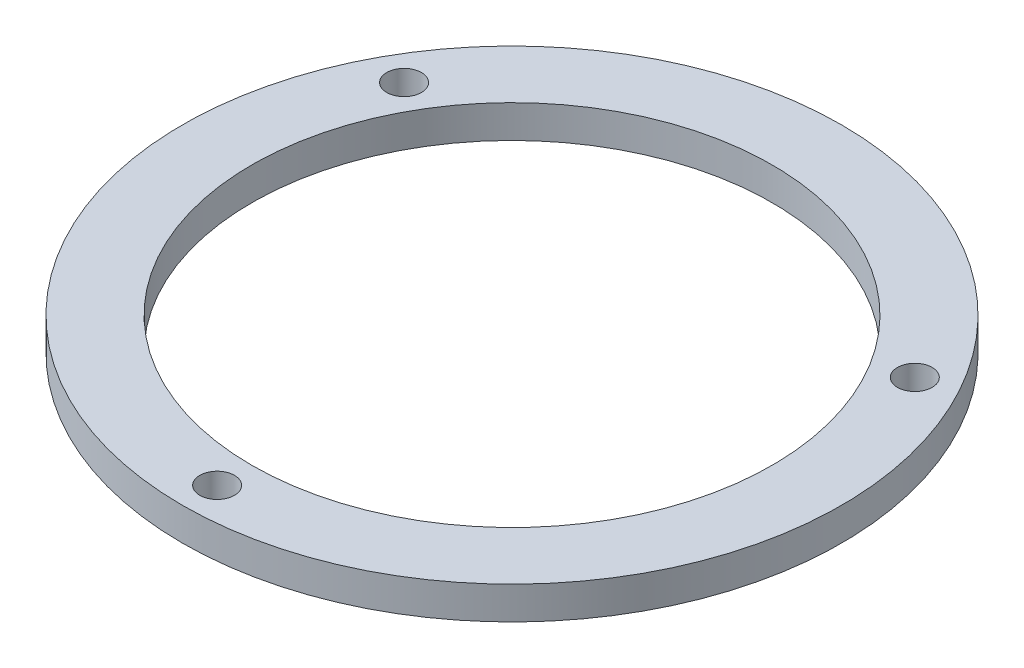
ISO-10303-21;
HEADER;
FILE_DESCRIPTION(('STEP AP214'),'2;1');
FILE_NAME('part.step','',(''),(''),'','','');
FILE_SCHEMA(('AUTOMOTIVE_DESIGN { 1 0 10303 214 1 1 1 1 }'));
ENDSEC;
DATA;
#1=APPLICATION_CONTEXT('core data for automotive mechanical design processes');
#2=APPLICATION_PROTOCOL_DEFINITION('international standard','automotive_design',2000,#1);
#3=PRODUCT_CONTEXT('',#1,'mechanical');
#4=PRODUCT('Part','Part','',(#3));
#5=PRODUCT_RELATED_PRODUCT_CATEGORY('part','',(#4));
#6=PRODUCT_DEFINITION_FORMATION('','',#4);
#7=PRODUCT_DEFINITION_CONTEXT('part definition',#1,'design');
#8=PRODUCT_DEFINITION('design','',#6,#7);
#9=PRODUCT_DEFINITION_SHAPE('','',#8);
#10=(LENGTH_UNIT() NAMED_UNIT(*) SI_UNIT(.MILLI.,.METRE.));
#11=(NAMED_UNIT(*) PLANE_ANGLE_UNIT() SI_UNIT($,.RADIAN.));
#12=(NAMED_UNIT(*) SI_UNIT($,.STERADIAN.) SOLID_ANGLE_UNIT());
#13=UNCERTAINTY_MEASURE_WITH_UNIT(LENGTH_MEASURE(1.E-05),#10,'distance_accuracy_value','');
#14=(GEOMETRIC_REPRESENTATION_CONTEXT(3) GLOBAL_UNCERTAINTY_ASSIGNED_CONTEXT((#13)) GLOBAL_UNIT_ASSIGNED_CONTEXT((#10,
#11,#12)) REPRESENTATION_CONTEXT('',''));
#15=CARTESIAN_POINT('',(0.,0.,0.));
#16=DIRECTION('',(0.,0.,1.));
#17=DIRECTION('',(1.,0.,0.));
#18=AXIS2_PLACEMENT_3D('',#15,#16,#17);
#19=CARTESIAN_POINT('',(0.,6.,0.));
#20=DIRECTION('',(0.,1.,0.));
#21=DIRECTION('',(0.,0.,1.));
#22=AXIS2_PLACEMENT_3D('',#19,#20,#21);
#23=PLANE('',#22);
#24=CARTESIAN_POINT('',(-46.7657182145212,6.,-27.0002));
#25=DIRECTION('',(0.,1.,0.));
#26=DIRECTION('',(0.,0.,1.));
#27=AXIS2_PLACEMENT_3D('',#24,#25,#26);
#28=CIRCLE('',#27,3.175);
#29=CARTESIAN_POINT('',(-46.7657182145212,6.,-23.8252));
#30=VERTEX_POINT('',#29);
#31=EDGE_CURVE('E89',#30,#30,#28,.T.);
#32=ORIENTED_EDGE('',*,*,#31,.F.);
#33=EDGE_LOOP('',(#32));
#34=FACE_BOUND('',#33,.T.);
#35=CARTESIAN_POINT('',(0.,6.,54.0004));
#36=DIRECTION('',(0.,1.,0.));
#37=DIRECTION('',(0.,0.,1.));
#38=AXIS2_PLACEMENT_3D('',#35,#36,#37);
#39=CIRCLE('',#38,3.175);
#40=CARTESIAN_POINT('',(0.,6.,57.1754));
#41=VERTEX_POINT('',#40);
#42=EDGE_CURVE('E78',#41,#41,#39,.T.);
#43=ORIENTED_EDGE('',*,*,#42,.F.);
#44=EDGE_LOOP('',(#43));
#45=FACE_BOUND('',#44,.T.);
#46=CARTESIAN_POINT('',(0.,6.,0.));
#47=DIRECTION('',(0.,1.,0.));
#48=DIRECTION('',(0.,0.,1.));
#49=AXIS2_PLACEMENT_3D('',#46,#47,#48);
#50=CIRCLE('',#49,60.3504);
#51=CARTESIAN_POINT('',(0.,6.,60.3504));
#52=VERTEX_POINT('',#51);
#53=EDGE_CURVE('E11',#52,#52,#50,.T.);
#54=ORIENTED_EDGE('',*,*,#53,.T.);
#55=EDGE_LOOP('',(#54));
#56=FACE_BOUND('',#55,.T.);
#57=CARTESIAN_POINT('',(46.7657182145212,6.,-27.0002));
#58=DIRECTION('',(0.,1.,0.));
#59=DIRECTION('',(0.,0.,1.));
#60=AXIS2_PLACEMENT_3D('',#57,#58,#59);
#61=CIRCLE('',#60,3.17499999999999);
#62=CARTESIAN_POINT('',(46.7657182145212,6.,-23.8252));
#63=VERTEX_POINT('',#62);
#64=EDGE_CURVE('E83',#63,#63,#61,.T.);
#65=ORIENTED_EDGE('',*,*,#64,.F.);
#66=EDGE_LOOP('',(#65));
#67=FACE_BOUND('',#66,.T.);
#68=CARTESIAN_POINT('',(0.,6.,0.));
#69=DIRECTION('',(0.,1.,0.));
#70=DIRECTION('',(0.,0.,1.));
#71=AXIS2_PLACEMENT_3D('',#68,#69,#70);
#72=CIRCLE('',#71,47.6504);
#73=CARTESIAN_POINT('',(0.,6.,47.6504));
#74=VERTEX_POINT('',#73);
#75=EDGE_CURVE('E95',#74,#74,#72,.T.);
#76=ORIENTED_EDGE('',*,*,#75,.F.);
#77=EDGE_LOOP('',(#76));
#78=FACE_BOUND('',#77,.T.);
#79=ADVANCED_FACE('F67',(#34,#45,#56,#67,#78),#23,.T.);
#80=CARTESIAN_POINT('',(0.,0.,0.));
#81=DIRECTION('',(0.,1.,0.));
#82=DIRECTION('',(0.,0.,1.));
#83=AXIS2_PLACEMENT_3D('',#80,#81,#82);
#84=PLANE('',#83);
#85=CARTESIAN_POINT('',(0.,0.,0.));
#86=DIRECTION('',(0.,1.,0.));
#87=DIRECTION('',(0.,0.,1.));
#88=AXIS2_PLACEMENT_3D('',#85,#86,#87);
#89=CIRCLE('',#88,60.3504);
#90=CARTESIAN_POINT('',(0.,0.,60.3504));
#91=VERTEX_POINT('',#90);
#92=EDGE_CURVE('E71',#91,#91,#89,.T.);
#93=ORIENTED_EDGE('',*,*,#92,.F.);
#94=EDGE_LOOP('',(#93));
#95=FACE_BOUND('',#94,.T.);
#96=CARTESIAN_POINT('',(0.,0.,54.0004));
#97=DIRECTION('',(0.,1.,0.));
#98=DIRECTION('',(0.,0.,1.));
#99=AXIS2_PLACEMENT_3D('',#96,#97,#98);
#100=CIRCLE('',#99,3.175);
#101=CARTESIAN_POINT('',(0.,0.,57.1754));
#102=VERTEX_POINT('',#101);
#103=EDGE_CURVE('E80',#102,#102,#100,.T.);
#104=ORIENTED_EDGE('',*,*,#103,.T.);
#105=EDGE_LOOP('',(#104));
#106=FACE_BOUND('',#105,.T.);
#107=CARTESIAN_POINT('',(46.7657182145212,0.,-27.0002));
#108=DIRECTION('',(0.,1.,0.));
#109=DIRECTION('',(0.,0.,1.));
#110=AXIS2_PLACEMENT_3D('',#107,#108,#109);
#111=CIRCLE('',#110,3.17499999999999);
#112=CARTESIAN_POINT('',(46.7657182145212,0.,-23.8252));
#113=VERTEX_POINT('',#112);
#114=EDGE_CURVE('E86',#113,#113,#111,.T.);
#115=ORIENTED_EDGE('',*,*,#114,.T.);
#116=EDGE_LOOP('',(#115));
#117=FACE_BOUND('',#116,.T.);
#118=CARTESIAN_POINT('',(-46.7657182145212,0.,-27.0002));
#119=DIRECTION('',(0.,1.,0.));
#120=DIRECTION('',(0.,0.,1.));
#121=AXIS2_PLACEMENT_3D('',#118,#119,#120);
#122=CIRCLE('',#121,3.175);
#123=CARTESIAN_POINT('',(-46.7657182145212,0.,-23.8252));
#124=VERTEX_POINT('',#123);
#125=EDGE_CURVE('E92',#124,#124,#122,.T.);
#126=ORIENTED_EDGE('',*,*,#125,.T.);
#127=EDGE_LOOP('',(#126));
#128=FACE_BOUND('',#127,.T.);
#129=CARTESIAN_POINT('',(0.,0.,0.));
#130=DIRECTION('',(0.,1.,0.));
#131=DIRECTION('',(0.,0.,1.));
#132=AXIS2_PLACEMENT_3D('',#129,#130,#131);
#133=CIRCLE('',#132,47.6504);
#134=CARTESIAN_POINT('',(0.,0.,47.6504));
#135=VERTEX_POINT('',#134);
#136=EDGE_CURVE('E98',#135,#135,#133,.T.);
#137=ORIENTED_EDGE('',*,*,#136,.T.);
#138=EDGE_LOOP('',(#137));
#139=FACE_BOUND('',#138,.T.);
#140=ADVANCED_FACE('F108',(#95,#106,#117,#128,#139),#84,.F.);
#141=CARTESIAN_POINT('',(0.,6.,0.));
#142=DIRECTION('',(0.,-1.,0.));
#143=DIRECTION('',(0.,0.,-1.));
#144=AXIS2_PLACEMENT_3D('',#141,#142,#143);
#145=CYLINDRICAL_SURFACE('',#144,60.3504);
#146=ORIENTED_EDGE('',*,*,#53,.F.);
#147=EDGE_LOOP('',(#146));
#148=FACE_BOUND('',#147,.T.);
#149=ORIENTED_EDGE('',*,*,#92,.T.);
#150=EDGE_LOOP('',(#149));
#151=FACE_BOUND('',#150,.T.);
#152=ADVANCED_FACE('F69',(#148,#151),#145,.T.);
#153=CARTESIAN_POINT('',(0.,6.,54.0004));
#154=DIRECTION('',(0.,-1.,0.));
#155=DIRECTION('',(0.,0.,-1.));
#156=AXIS2_PLACEMENT_3D('',#153,#154,#155);
#157=CYLINDRICAL_SURFACE('',#156,3.175);
#158=ORIENTED_EDGE('',*,*,#42,.T.);
#159=EDGE_LOOP('',(#158));
#160=FACE_BOUND('',#159,.T.);
#161=ORIENTED_EDGE('',*,*,#103,.F.);
#162=EDGE_LOOP('',(#161));
#163=FACE_BOUND('',#162,.T.);
#164=ADVANCED_FACE('F118',(#160,#163),#157,.F.);
#165=CARTESIAN_POINT('',(46.7657182145212,6.,-27.0002));
#166=DIRECTION('',(0.,-1.,0.));
#167=DIRECTION('',(0.,0.,-1.));
#168=AXIS2_PLACEMENT_3D('',#165,#166,#167);
#169=CYLINDRICAL_SURFACE('',#168,3.17499999999999);
#170=ORIENTED_EDGE('',*,*,#64,.T.);
#171=EDGE_LOOP('',(#170));
#172=FACE_BOUND('',#171,.T.);
#173=ORIENTED_EDGE('',*,*,#114,.F.);
#174=EDGE_LOOP('',(#173));
#175=FACE_BOUND('',#174,.T.);
#176=ADVANCED_FACE('F121',(#172,#175),#169,.F.);
#177=CARTESIAN_POINT('',(-46.7657182145212,6.,-27.0002));
#178=DIRECTION('',(0.,-1.,0.));
#179=DIRECTION('',(0.,0.,-1.));
#180=AXIS2_PLACEMENT_3D('',#177,#178,#179);
#181=CYLINDRICAL_SURFACE('',#180,3.175);
#182=ORIENTED_EDGE('',*,*,#31,.T.);
#183=EDGE_LOOP('',(#182));
#184=FACE_BOUND('',#183,.T.);
#185=ORIENTED_EDGE('',*,*,#125,.F.);
#186=EDGE_LOOP('',(#185));
#187=FACE_BOUND('',#186,.T.);
#188=ADVANCED_FACE('F125',(#184,#187),#181,.F.);
#189=CARTESIAN_POINT('',(0.,6.,0.));
#190=DIRECTION('',(0.,-1.,0.));
#191=DIRECTION('',(0.,0.,-1.));
#192=AXIS2_PLACEMENT_3D('',#189,#190,#191);
#193=CYLINDRICAL_SURFACE('',#192,47.6504);
#194=ORIENTED_EDGE('',*,*,#75,.T.);
#195=EDGE_LOOP('',(#194));
#196=FACE_BOUND('',#195,.T.);
#197=ORIENTED_EDGE('',*,*,#136,.F.);
#198=EDGE_LOOP('',(#197));
#199=FACE_BOUND('',#198,.T.);
#200=ADVANCED_FACE('F104',(#196,#199),#193,.F.);
#201=CLOSED_SHELL('',(#79,#140,#152,#164,#176,#188,#200));
#202=MANIFOLD_SOLID_BREP('B2',#201);
#203=ADVANCED_BREP_SHAPE_REPRESENTATION('',(#18,#202),#14);
#204=SHAPE_DEFINITION_REPRESENTATION(#9,#203);
ENDSEC;
END-ISO-10303-21;
